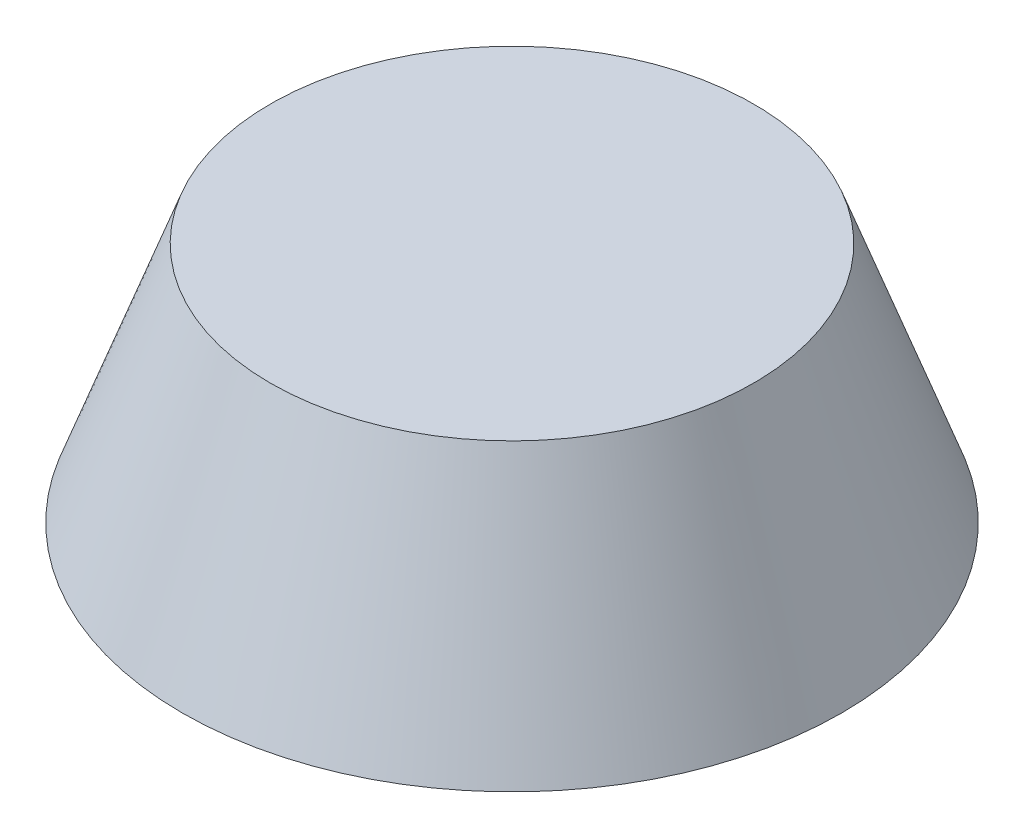
ISO-10303-21;
HEADER;
FILE_DESCRIPTION(('STEP AP214'),'2;1');
FILE_NAME('part.step','',(''),(''),'','','');
FILE_SCHEMA(('AUTOMOTIVE_DESIGN { 1 0 10303 214 1 1 1 1 }'));
ENDSEC;
DATA;
#1=APPLICATION_CONTEXT('core data for automotive mechanical design processes');
#2=APPLICATION_PROTOCOL_DEFINITION('international standard','automotive_design',2000,#1);
#3=PRODUCT_CONTEXT('',#1,'mechanical');
#4=PRODUCT('Part','Part','',(#3));
#5=PRODUCT_RELATED_PRODUCT_CATEGORY('part','',(#4));
#6=PRODUCT_DEFINITION_FORMATION('','',#4);
#7=PRODUCT_DEFINITION_CONTEXT('part definition',#1,'design');
#8=PRODUCT_DEFINITION('design','',#6,#7);
#9=PRODUCT_DEFINITION_SHAPE('','',#8);
#10=(LENGTH_UNIT() NAMED_UNIT(*) SI_UNIT(.MILLI.,.METRE.));
#11=(NAMED_UNIT(*) PLANE_ANGLE_UNIT() SI_UNIT($,.RADIAN.));
#12=(NAMED_UNIT(*) SI_UNIT($,.STERADIAN.) SOLID_ANGLE_UNIT());
#13=UNCERTAINTY_MEASURE_WITH_UNIT(LENGTH_MEASURE(1.E-05),#10,'distance_accuracy_value','');
#14=(GEOMETRIC_REPRESENTATION_CONTEXT(3) GLOBAL_UNCERTAINTY_ASSIGNED_CONTEXT((#13)) GLOBAL_UNIT_ASSIGNED_CONTEXT((#10,
#11,#12)) REPRESENTATION_CONTEXT('',''));
#15=CARTESIAN_POINT('',(0.,0.,0.));
#16=DIRECTION('',(0.,0.,1.));
#17=DIRECTION('',(1.,0.,0.));
#18=AXIS2_PLACEMENT_3D('',#15,#16,#17);
#19=CARTESIAN_POINT('',(0.,3.,0.));
#20=DIRECTION('',(0.,-1.,0.));
#21=DIRECTION('',(0.,0.,1.));
#22=AXIS2_PLACEMENT_3D('',#19,#20,#21);
#23=CONICAL_SURFACE('',#22,3.,0.349065850398867);
#24=CARTESIAN_POINT('',(0.,3.,0.));
#25=DIRECTION('',(0.,1.,0.));
#26=DIRECTION('',(0.,0.,1.));
#27=AXIS2_PLACEMENT_3D('',#24,#25,#26);
#28=CIRCLE('',#27,3.);
#29=CARTESIAN_POINT('',(0.,3.,3.));
#30=VERTEX_POINT('',#29);
#31=EDGE_CURVE('E10',#30,#30,#28,.T.);
#32=ORIENTED_EDGE('',*,*,#31,.F.);
#33=EDGE_LOOP('',(#32));
#34=FACE_BOUND('',#33,.T.);
#35=CARTESIAN_POINT('',(0.,0.,0.));
#36=DIRECTION('',(0.,1.,0.));
#37=DIRECTION('',(0.,0.,1.));
#38=AXIS2_PLACEMENT_3D('',#35,#36,#37);
#39=CIRCLE('',#38,4.09191070279861);
#40=CARTESIAN_POINT('',(0.,0.,4.09191070279861));
#41=VERTEX_POINT('',#40);
#42=EDGE_CURVE('E46',#41,#41,#39,.T.);
#43=ORIENTED_EDGE('',*,*,#42,.T.);
#44=EDGE_LOOP('',(#43));
#45=FACE_BOUND('',#44,.T.);
#46=ADVANCED_FACE('F43',(#34,#45),#23,.T.);
#47=CARTESIAN_POINT('',(0.,3.,0.));
#48=DIRECTION('',(0.,1.,0.));
#49=DIRECTION('',(0.,0.,1.));
#50=AXIS2_PLACEMENT_3D('',#47,#48,#49);
#51=PLANE('',#50);
#52=ORIENTED_EDGE('',*,*,#31,.T.);
#53=EDGE_LOOP('',(#52));
#54=FACE_BOUND('',#53,.T.);
#55=ADVANCED_FACE('F58',(#54),#51,.T.);
#56=CARTESIAN_POINT('',(0.,0.,0.));
#57=DIRECTION('',(0.,1.,0.));
#58=DIRECTION('',(0.,0.,1.));
#59=AXIS2_PLACEMENT_3D('',#56,#57,#58);
#60=PLANE('',#59);
#61=ORIENTED_EDGE('',*,*,#42,.F.);
#62=EDGE_LOOP('',(#61));
#63=FACE_BOUND('',#62,.T.);
#64=ADVANCED_FACE('F56',(#63),#60,.F.);
#65=CLOSED_SHELL('',(#46,#55,#64));
#66=MANIFOLD_SOLID_BREP('B2',#65);
#67=ADVANCED_BREP_SHAPE_REPRESENTATION('',(#18,#66),#14);
#68=SHAPE_DEFINITION_REPRESENTATION(#9,#67);
ENDSEC;
END-ISO-10303-21;
